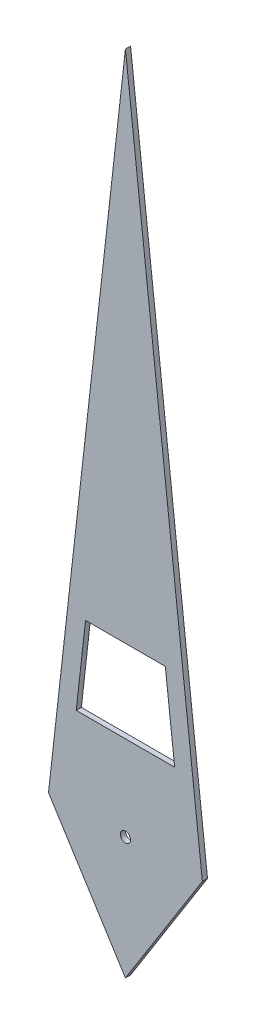
ISO-10303-21;
HEADER;
FILE_DESCRIPTION(('STEP AP214'),'2;1');
FILE_NAME('part.step','',(''),(''),'','','');
FILE_SCHEMA(('AUTOMOTIVE_DESIGN { 1 0 10303 214 1 1 1 1 }'));
ENDSEC;
DATA;
#1=APPLICATION_CONTEXT('core data for automotive mechanical design processes');
#2=APPLICATION_PROTOCOL_DEFINITION('international standard','automotive_design',2000,#1);
#3=PRODUCT_CONTEXT('',#1,'mechanical');
#4=PRODUCT('Part','Part','',(#3));
#5=PRODUCT_RELATED_PRODUCT_CATEGORY('part','',(#4));
#6=PRODUCT_DEFINITION_FORMATION('','',#4);
#7=PRODUCT_DEFINITION_CONTEXT('part definition',#1,'design');
#8=PRODUCT_DEFINITION('design','',#6,#7);
#9=PRODUCT_DEFINITION_SHAPE('','',#8);
#10=(LENGTH_UNIT() NAMED_UNIT(*) SI_UNIT(.MILLI.,.METRE.));
#11=(NAMED_UNIT(*) PLANE_ANGLE_UNIT() SI_UNIT($,.RADIAN.));
#12=(NAMED_UNIT(*) SI_UNIT($,.STERADIAN.) SOLID_ANGLE_UNIT());
#13=UNCERTAINTY_MEASURE_WITH_UNIT(LENGTH_MEASURE(1.E-05),#10,'distance_accuracy_value','');
#14=(GEOMETRIC_REPRESENTATION_CONTEXT(3) GLOBAL_UNCERTAINTY_ASSIGNED_CONTEXT((#13)) GLOBAL_UNIT_ASSIGNED_CONTEXT((#10,
#11,#12)) REPRESENTATION_CONTEXT('',''));
#15=CARTESIAN_POINT('',(0.,0.,0.));
#16=DIRECTION('',(0.,0.,1.));
#17=DIRECTION('',(1.,0.,0.));
#18=AXIS2_PLACEMENT_3D('',#15,#16,#17);
#19=CARTESIAN_POINT('',(-1.5,0.,0.1));
#20=DIRECTION('',(0.,0.,1.));
#21=DIRECTION('',(1.,0.,0.));
#22=AXIS2_PLACEMENT_3D('',#19,#20,#21);
#23=PLANE('',#22);
#24=DIRECTION('',(-0.112047655923588,0.993702834252791,0.));
#25=VECTOR('',#24,1.);
#26=CARTESIAN_POINT('',(0.959190931114726,1.65808016240534,0.1));
#27=LINE('',#26,#25);
#28=CARTESIAN_POINT('',(0.959190931114726,1.65808016240534,0.1));
#29=VERTEX_POINT('',#28);
#30=CARTESIAN_POINT('',(0.777629766132319,3.26826863753323,0.1));
#31=VERTEX_POINT('',#30);
#32=EDGE_CURVE('E48',#29,#31,#27,.T.);
#33=ORIENTED_EDGE('',*,*,#32,.F.);
#34=DIRECTION('',(1.,0.,0.));
#35=VECTOR('',#34,1.);
#36=CARTESIAN_POINT('',(-0.959190931114726,1.65808016240534,0.1));
#37=LINE('',#36,#35);
#38=CARTESIAN_POINT('',(-0.959190931114726,1.65808016240534,0.1));
#39=VERTEX_POINT('',#38);
#40=EDGE_CURVE('E116',#39,#29,#37,.T.);
#41=ORIENTED_EDGE('',*,*,#40,.F.);
#42=DIRECTION('',(-0.112047655923588,-0.993702834252791,0.));
#43=VECTOR('',#42,1.);
#44=CARTESIAN_POINT('',(-0.959190931114726,1.65808016240534,0.1));
#45=LINE('',#44,#43);
#46=CARTESIAN_POINT('',(-0.777629766132319,3.26826863753323,0.1));
#47=VERTEX_POINT('',#46);
#48=EDGE_CURVE('E119',#47,#39,#45,.T.);
#49=ORIENTED_EDGE('',*,*,#48,.F.);
#50=DIRECTION('',(-1.,0.,0.));
#51=VECTOR('',#50,1.);
#52=CARTESIAN_POINT('',(-0.777629766132319,3.26826863753323,0.1));
#53=LINE('',#52,#51);
#54=EDGE_CURVE('E125',#31,#47,#53,.T.);
#55=ORIENTED_EDGE('',*,*,#54,.F.);
#56=EDGE_LOOP('',(#33,#41,#49,#55));
#57=FACE_BOUND('',#56,.T.);
#58=DIRECTION('',(-0.112047655923588,-0.993702834252791,0.));
#59=VECTOR('',#58,1.);
#60=CARTESIAN_POINT('',(0.,13.3028597438548,0.1));
#61=LINE('',#60,#59);
#62=CARTESIAN_POINT('',(0.,13.3028597438548,0.1));
#63=VERTEX_POINT('',#62);
#64=CARTESIAN_POINT('',(-1.5,0.,0.1));
#65=VERTEX_POINT('',#64);
#66=EDGE_CURVE('E141',#63,#65,#61,.T.);
#67=ORIENTED_EDGE('',*,*,#66,.T.);
#68=DIRECTION('',(0.53314934330902,-0.846021144965751,0.));
#69=VECTOR('',#68,1.);
#70=CARTESIAN_POINT('',(-1.5,0.,0.1));
#71=LINE('',#70,#69);
#72=CARTESIAN_POINT('',(0.,-2.38025561388168,0.1));
#73=VERTEX_POINT('',#72);
#74=EDGE_CURVE('E144',#65,#73,#71,.T.);
#75=ORIENTED_EDGE('',*,*,#74,.T.);
#76=DIRECTION('',(0.53314934330902,0.846021144965751,0.));
#77=VECTOR('',#76,1.);
#78=CARTESIAN_POINT('',(1.5,0.,0.1));
#79=LINE('',#78,#77);
#80=CARTESIAN_POINT('',(1.5,0.,0.1));
#81=VERTEX_POINT('',#80);
#82=EDGE_CURVE('E147',#73,#81,#79,.T.);
#83=ORIENTED_EDGE('',*,*,#82,.T.);
#84=DIRECTION('',(-0.112047655923588,0.993702834252791,0.));
#85=VECTOR('',#84,1.);
#86=CARTESIAN_POINT('',(0.,13.3028597438548,0.1));
#87=LINE('',#86,#85);
#88=EDGE_CURVE('E149',#81,#63,#87,.T.);
#89=ORIENTED_EDGE('',*,*,#88,.T.);
#90=EDGE_LOOP('',(#67,#75,#83,#89));
#91=FACE_BOUND('',#90,.T.);
#92=CARTESIAN_POINT('',(0.,0.,0.1));
#93=DIRECTION('',(0.,0.,1.));
#94=DIRECTION('',(1.,0.,0.));
#95=AXIS2_PLACEMENT_3D('',#92,#93,#94);
#96=CIRCLE('',#95,0.1);
#97=CARTESIAN_POINT('',(0.1,0.,0.1));
#98=VERTEX_POINT('',#97);
#99=EDGE_CURVE('E135',#98,#98,#96,.T.);
#100=ORIENTED_EDGE('',*,*,#99,.F.);
#101=EDGE_LOOP('',(#100));
#102=FACE_BOUND('',#101,.T.);
#103=ADVANCED_FACE('F33',(#57,#91,#102),#23,.T.);
#104=CARTESIAN_POINT('',(-1.5,0.,0.));
#105=DIRECTION('',(0.,0.,1.));
#106=DIRECTION('',(1.,0.,0.));
#107=AXIS2_PLACEMENT_3D('',#104,#105,#106);
#108=PLANE('',#107);
#109=DIRECTION('',(1.,0.,0.));
#110=VECTOR('',#109,1.);
#111=CARTESIAN_POINT('',(-0.959190931114726,1.65808016240534,0.));
#112=LINE('',#111,#110);
#113=CARTESIAN_POINT('',(-0.959190931114726,1.65808016240534,0.));
#114=VERTEX_POINT('',#113);
#115=CARTESIAN_POINT('',(0.959190931114726,1.65808016240534,0.));
#116=VERTEX_POINT('',#115);
#117=EDGE_CURVE('E106',#114,#116,#112,.T.);
#118=ORIENTED_EDGE('',*,*,#117,.T.);
#119=DIRECTION('',(-0.112047655923588,0.993702834252791,0.));
#120=VECTOR('',#119,1.);
#121=CARTESIAN_POINT('',(0.959190931114726,1.65808016240534,0.));
#122=LINE('',#121,#120);
#123=CARTESIAN_POINT('',(0.777629766132319,3.26826863753323,0.));
#124=VERTEX_POINT('',#123);
#125=EDGE_CURVE('E100',#116,#124,#122,.T.);
#126=ORIENTED_EDGE('',*,*,#125,.T.);
#127=DIRECTION('',(-1.,0.,0.));
#128=VECTOR('',#127,1.);
#129=CARTESIAN_POINT('',(-0.777629766132319,3.26826863753323,0.));
#130=LINE('',#129,#128);
#131=CARTESIAN_POINT('',(-0.777629766132319,3.26826863753323,0.));
#132=VERTEX_POINT('',#131);
#133=EDGE_CURVE('E109',#124,#132,#130,.T.);
#134=ORIENTED_EDGE('',*,*,#133,.T.);
#135=DIRECTION('',(-0.112047655923588,-0.993702834252791,0.));
#136=VECTOR('',#135,1.);
#137=CARTESIAN_POINT('',(-0.959190931114726,1.65808016240534,0.));
#138=LINE('',#137,#136);
#139=EDGE_CURVE('E56',#132,#114,#138,.T.);
#140=ORIENTED_EDGE('',*,*,#139,.T.);
#141=EDGE_LOOP('',(#118,#126,#134,#140));
#142=FACE_BOUND('',#141,.T.);
#143=DIRECTION('',(-0.112047655923588,-0.993702834252791,0.));
#144=VECTOR('',#143,1.);
#145=CARTESIAN_POINT('',(0.,13.3028597438548,0.));
#146=LINE('',#145,#144);
#147=CARTESIAN_POINT('',(0.,13.3028597438548,0.));
#148=VERTEX_POINT('',#147);
#149=CARTESIAN_POINT('',(-1.5,0.,0.));
#150=VERTEX_POINT('',#149);
#151=EDGE_CURVE('E138',#148,#150,#146,.T.);
#152=ORIENTED_EDGE('',*,*,#151,.F.);
#153=DIRECTION('',(-0.112047655923588,0.993702834252791,0.));
#154=VECTOR('',#153,1.);
#155=CARTESIAN_POINT('',(0.,13.3028597438548,0.));
#156=LINE('',#155,#154);
#157=CARTESIAN_POINT('',(1.5,0.,0.));
#158=VERTEX_POINT('',#157);
#159=EDGE_CURVE('E145',#158,#148,#156,.T.);
#160=ORIENTED_EDGE('',*,*,#159,.F.);
#161=DIRECTION('',(0.53314934330902,0.846021144965751,0.));
#162=VECTOR('',#161,1.);
#163=CARTESIAN_POINT('',(1.5,0.,0.));
#164=LINE('',#163,#162);
#165=CARTESIAN_POINT('',(0.,-2.38025561388168,0.));
#166=VERTEX_POINT('',#165);
#167=EDGE_CURVE('E156',#166,#158,#164,.T.);
#168=ORIENTED_EDGE('',*,*,#167,.F.);
#169=DIRECTION('',(0.53314934330902,-0.846021144965751,0.));
#170=VECTOR('',#169,1.);
#171=CARTESIAN_POINT('',(-1.5,0.,0.));
#172=LINE('',#171,#170);
#173=EDGE_CURVE('E154',#150,#166,#172,.T.);
#174=ORIENTED_EDGE('',*,*,#173,.F.);
#175=EDGE_LOOP('',(#152,#160,#168,#174));
#176=FACE_BOUND('',#175,.T.);
#177=CARTESIAN_POINT('',(0.,0.,0.));
#178=DIRECTION('',(0.,0.,1.));
#179=DIRECTION('',(1.,0.,0.));
#180=AXIS2_PLACEMENT_3D('',#177,#178,#179);
#181=CIRCLE('',#180,0.1);
#182=CARTESIAN_POINT('',(0.1,0.,0.));
#183=VERTEX_POINT('',#182);
#184=EDGE_CURVE('E131',#183,#183,#181,.T.);
#185=ORIENTED_EDGE('',*,*,#184,.T.);
#186=EDGE_LOOP('',(#185));
#187=FACE_BOUND('',#186,.T.);
#188=ADVANCED_FACE('F113',(#142,#176,#187),#108,.F.);
#189=CARTESIAN_POINT('',(0.,13.3028597438548,0.1));
#190=DIRECTION('',(0.993702834252791,-0.112047655923588,0.));
#191=DIRECTION('',(0.112047655923588,0.993702834252791,0.));
#192=AXIS2_PLACEMENT_3D('',#189,#190,#191);
#193=PLANE('',#192);
#194=ORIENTED_EDGE('',*,*,#151,.T.);
#195=DIRECTION('',(0.,0.,-1.));
#196=VECTOR('',#195,1.);
#197=CARTESIAN_POINT('',(-1.5,0.,0.1));
#198=LINE('',#197,#196);
#199=EDGE_CURVE('E11',#65,#150,#198,.T.);
#200=ORIENTED_EDGE('',*,*,#199,.F.);
#201=ORIENTED_EDGE('',*,*,#66,.F.);
#202=DIRECTION('',(0.,0.,-1.));
#203=VECTOR('',#202,1.);
#204=CARTESIAN_POINT('',(0.,13.3028597438548,0.1));
#205=LINE('',#204,#203);
#206=EDGE_CURVE('E151',#63,#148,#205,.T.);
#207=ORIENTED_EDGE('',*,*,#206,.T.);
#208=EDGE_LOOP('',(#194,#200,#201,#207));
#209=FACE_BOUND('',#208,.T.);
#210=ADVANCED_FACE('F35',(#209),#193,.F.);
#211=CARTESIAN_POINT('',(-1.5,0.,0.1));
#212=DIRECTION('',(0.846021144965751,0.53314934330902,0.));
#213=DIRECTION('',(-0.53314934330902,0.846021144965751,0.));
#214=AXIS2_PLACEMENT_3D('',#211,#212,#213);
#215=PLANE('',#214);
#216=ORIENTED_EDGE('',*,*,#173,.T.);
#217=DIRECTION('',(0.,0.,-1.));
#218=VECTOR('',#217,1.);
#219=CARTESIAN_POINT('',(0.,-2.38025561388168,0.1));
#220=LINE('',#219,#218);
#221=EDGE_CURVE('E41',#73,#166,#220,.T.);
#222=ORIENTED_EDGE('',*,*,#221,.F.);
#223=ORIENTED_EDGE('',*,*,#74,.F.);
#224=ORIENTED_EDGE('',*,*,#199,.T.);
#225=EDGE_LOOP('',(#216,#222,#223,#224));
#226=FACE_BOUND('',#225,.T.);
#227=ADVANCED_FACE('F183',(#226),#215,.F.);
#228=CARTESIAN_POINT('',(1.5,0.,0.1));
#229=DIRECTION('',(-0.846021144965751,0.53314934330902,0.));
#230=DIRECTION('',(-0.53314934330902,-0.846021144965751,0.));
#231=AXIS2_PLACEMENT_3D('',#228,#229,#230);
#232=PLANE('',#231);
#233=ORIENTED_EDGE('',*,*,#167,.T.);
#234=DIRECTION('',(0.,0.,-1.));
#235=VECTOR('',#234,1.);
#236=CARTESIAN_POINT('',(1.5,0.,0.1));
#237=LINE('',#236,#235);
#238=EDGE_CURVE('E161',#81,#158,#237,.T.);
#239=ORIENTED_EDGE('',*,*,#238,.F.);
#240=ORIENTED_EDGE('',*,*,#82,.F.);
#241=ORIENTED_EDGE('',*,*,#221,.T.);
#242=EDGE_LOOP('',(#233,#239,#240,#241));
#243=FACE_BOUND('',#242,.T.);
#244=ADVANCED_FACE('F168',(#243),#232,.F.);
#245=CARTESIAN_POINT('',(0.,13.3028597438548,0.1));
#246=DIRECTION('',(-0.993702834252791,-0.112047655923588,0.));
#247=DIRECTION('',(0.112047655923588,-0.993702834252791,0.));
#248=AXIS2_PLACEMENT_3D('',#245,#246,#247);
#249=PLANE('',#248);
#250=ORIENTED_EDGE('',*,*,#159,.T.);
#251=ORIENTED_EDGE('',*,*,#206,.F.);
#252=ORIENTED_EDGE('',*,*,#88,.F.);
#253=ORIENTED_EDGE('',*,*,#238,.T.);
#254=EDGE_LOOP('',(#250,#251,#252,#253));
#255=FACE_BOUND('',#254,.T.);
#256=ADVANCED_FACE('F176',(#255),#249,.F.);
#257=CARTESIAN_POINT('',(0.,0.,0.1));
#258=DIRECTION('',(0.,0.,-1.));
#259=DIRECTION('',(-1.,0.,0.));
#260=AXIS2_PLACEMENT_3D('',#257,#258,#259);
#261=CYLINDRICAL_SURFACE('',#260,0.1);
#262=ORIENTED_EDGE('',*,*,#99,.T.);
#263=EDGE_LOOP('',(#262));
#264=FACE_BOUND('',#263,.T.);
#265=ORIENTED_EDGE('',*,*,#184,.F.);
#266=EDGE_LOOP('',(#265));
#267=FACE_BOUND('',#266,.T.);
#268=ADVANCED_FACE('F198',(#264,#267),#261,.F.);
#269=CARTESIAN_POINT('',(0.959190931114726,1.65808016240534,0.));
#270=DIRECTION('',(0.993702834252791,0.112047655923588,0.));
#271=DIRECTION('',(-0.112047655923588,0.993702834252791,0.));
#272=AXIS2_PLACEMENT_3D('',#269,#270,#271);
#273=PLANE('',#272);
#274=ORIENTED_EDGE('',*,*,#32,.T.);
#275=DIRECTION('',(0.,0.,1.));
#276=VECTOR('',#275,1.);
#277=CARTESIAN_POINT('',(0.777629766132319,3.26826863753323,0.));
#278=LINE('',#277,#276);
#279=EDGE_CURVE('E96',#124,#31,#278,.T.);
#280=ORIENTED_EDGE('',*,*,#279,.F.);
#281=ORIENTED_EDGE('',*,*,#125,.F.);
#282=DIRECTION('',(0.,0.,1.));
#283=VECTOR('',#282,1.);
#284=CARTESIAN_POINT('',(0.959190931114726,1.65808016240534,0.));
#285=LINE('',#284,#283);
#286=EDGE_CURVE('E129',#116,#29,#285,.T.);
#287=ORIENTED_EDGE('',*,*,#286,.T.);
#288=EDGE_LOOP('',(#274,#280,#281,#287));
#289=FACE_BOUND('',#288,.T.);
#290=ADVANCED_FACE('F98',(#289),#273,.F.);
#291=CARTESIAN_POINT('',(-0.959190931114726,1.65808016240534,0.));
#292=DIRECTION('',(0.,-1.,0.));
#293=DIRECTION('',(0.,0.,-1.));
#294=AXIS2_PLACEMENT_3D('',#291,#292,#293);
#295=PLANE('',#294);
#296=ORIENTED_EDGE('',*,*,#40,.T.);
#297=ORIENTED_EDGE('',*,*,#286,.F.);
#298=ORIENTED_EDGE('',*,*,#117,.F.);
#299=DIRECTION('',(0.,0.,1.));
#300=VECTOR('',#299,1.);
#301=CARTESIAN_POINT('',(-0.959190931114726,1.65808016240534,0.));
#302=LINE('',#301,#300);
#303=EDGE_CURVE('E132',#114,#39,#302,.T.);
#304=ORIENTED_EDGE('',*,*,#303,.T.);
#305=EDGE_LOOP('',(#296,#297,#298,#304));
#306=FACE_BOUND('',#305,.T.);
#307=ADVANCED_FACE('F209',(#306),#295,.F.);
#308=CARTESIAN_POINT('',(-0.959190931114726,1.65808016240534,0.));
#309=DIRECTION('',(-0.993702834252791,0.112047655923588,0.));
#310=DIRECTION('',(-0.112047655923588,-0.993702834252791,0.));
#311=AXIS2_PLACEMENT_3D('',#308,#309,#310);
#312=PLANE('',#311);
#313=ORIENTED_EDGE('',*,*,#48,.T.);
#314=ORIENTED_EDGE('',*,*,#303,.F.);
#315=ORIENTED_EDGE('',*,*,#139,.F.);
#316=DIRECTION('',(0.,0.,1.));
#317=VECTOR('',#316,1.);
#318=CARTESIAN_POINT('',(-0.777629766132319,3.26826863753323,0.));
#319=LINE('',#318,#317);
#320=EDGE_CURVE('E105',#132,#47,#319,.T.);
#321=ORIENTED_EDGE('',*,*,#320,.T.);
#322=EDGE_LOOP('',(#313,#314,#315,#321));
#323=FACE_BOUND('',#322,.T.);
#324=ADVANCED_FACE('F216',(#323),#312,.F.);
#325=CARTESIAN_POINT('',(-0.777629766132319,3.26826863753323,0.));
#326=DIRECTION('',(0.,1.,0.));
#327=DIRECTION('',(0.,0.,1.));
#328=AXIS2_PLACEMENT_3D('',#325,#326,#327);
#329=PLANE('',#328);
#330=ORIENTED_EDGE('',*,*,#54,.T.);
#331=ORIENTED_EDGE('',*,*,#320,.F.);
#332=ORIENTED_EDGE('',*,*,#133,.F.);
#333=ORIENTED_EDGE('',*,*,#279,.T.);
#334=EDGE_LOOP('',(#330,#331,#332,#333));
#335=FACE_BOUND('',#334,.T.);
#336=ADVANCED_FACE('F110',(#335),#329,.F.);
#337=CLOSED_SHELL('',(#103,#188,#210,#227,#244,#256,#268,#290,#307,#324,#336));
#338=MANIFOLD_SOLID_BREP('B2',#337);
#339=ADVANCED_BREP_SHAPE_REPRESENTATION('',(#18,#338),#14);
#340=SHAPE_DEFINITION_REPRESENTATION(#9,#339);
ENDSEC;
END-ISO-10303-21;
